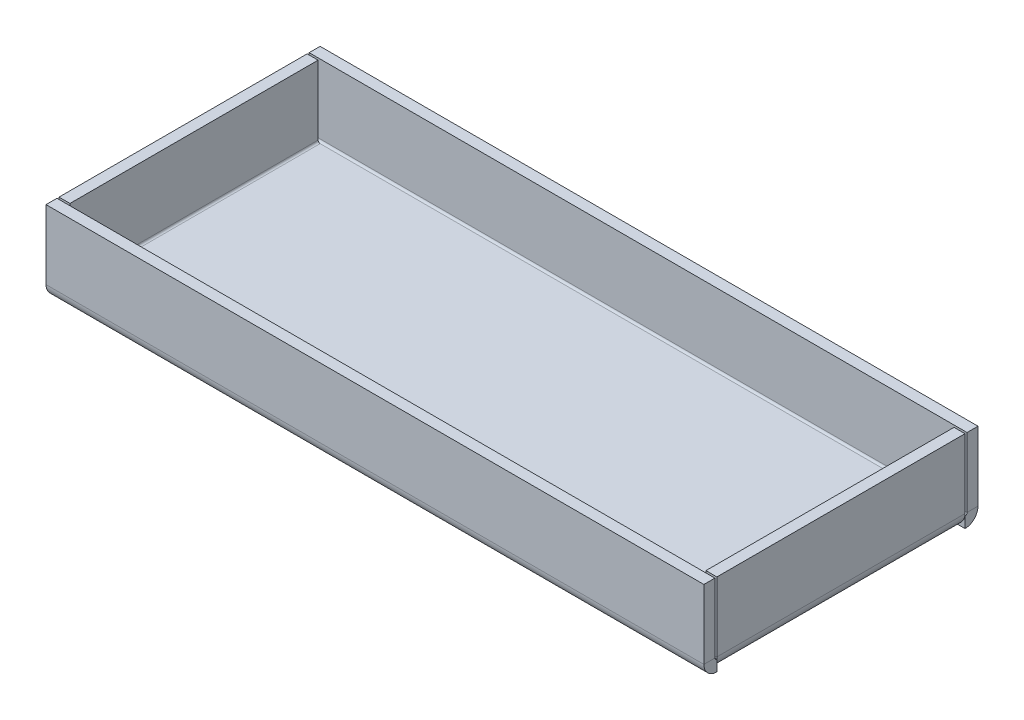
ISO-10303-21;
HEADER;
FILE_DESCRIPTION(('STEP AP214'),'2;1');
FILE_NAME('part.step','',(''),(''),'','','');
FILE_SCHEMA(('AUTOMOTIVE_DESIGN { 1 0 10303 214 1 1 1 1 }'));
ENDSEC;
DATA;
#1=APPLICATION_CONTEXT('core data for automotive mechanical design processes');
#2=APPLICATION_PROTOCOL_DEFINITION('international standard','automotive_design',2000,#1);
#3=PRODUCT_CONTEXT('',#1,'mechanical');
#4=PRODUCT('Part','Part','',(#3));
#5=PRODUCT_RELATED_PRODUCT_CATEGORY('part','',(#4));
#6=PRODUCT_DEFINITION_FORMATION('','',#4);
#7=PRODUCT_DEFINITION_CONTEXT('part definition',#1,'design');
#8=PRODUCT_DEFINITION('design','',#6,#7);
#9=PRODUCT_DEFINITION_SHAPE('','',#8);
#10=(LENGTH_UNIT() NAMED_UNIT(*) SI_UNIT(.MILLI.,.METRE.));
#11=(NAMED_UNIT(*) PLANE_ANGLE_UNIT() SI_UNIT($,.RADIAN.));
#12=(NAMED_UNIT(*) SI_UNIT($,.STERADIAN.) SOLID_ANGLE_UNIT());
#13=UNCERTAINTY_MEASURE_WITH_UNIT(LENGTH_MEASURE(1.E-05),#10,'distance_accuracy_value','');
#14=(GEOMETRIC_REPRESENTATION_CONTEXT(3) GLOBAL_UNCERTAINTY_ASSIGNED_CONTEXT((#13)) GLOBAL_UNIT_ASSIGNED_CONTEXT((#10,
#11,#12)) REPRESENTATION_CONTEXT('',''));
#15=CARTESIAN_POINT('',(0.,0.,0.));
#16=DIRECTION('',(0.,0.,1.));
#17=DIRECTION('',(1.,0.,0.));
#18=AXIS2_PLACEMENT_3D('',#15,#16,#17);
#19=CARTESIAN_POINT('',(0.,4.,-4.7366));
#20=DIRECTION('',(0.,0.,-1.));
#21=DIRECTION('',(-1.,0.,0.));
#22=AXIS2_PLACEMENT_3D('',#19,#20,#21);
#23=PLANE('',#22);
#24=DIRECTION('',(1.,0.,0.));
#25=VECTOR('',#24,1.);
#26=CARTESIAN_POINT('',(0.,4.,-4.7366));
#27=LINE('',#26,#25);
#28=CARTESIAN_POINT('',(0.,4.,-4.7366));
#29=VERTEX_POINT('',#28);
#30=CARTESIAN_POINT('',(0.0576257534369755,4.,-4.7366));
#31=VERTEX_POINT('',#30);
#32=EDGE_CURVE('E456',#29,#31,#27,.T.);
#33=ORIENTED_EDGE('',*,*,#32,.T.);
#34=CARTESIAN_POINT('',(4.7366,4.7366,-4.73659999999999));
#35=DIRECTION('',(0.,0.,1.));
#36=DIRECTION('',(1.,0.,0.));
#37=AXIS2_PLACEMENT_3D('',#34,#35,#36);
#38=CIRCLE('',#37,4.7366);
#39=CARTESIAN_POINT('',(4.7366,0.,-4.73659999999999));
#40=VERTEX_POINT('',#39);
#41=EDGE_CURVE('E13',#31,#40,#38,.T.);
#42=ORIENTED_EDGE('',*,*,#41,.T.);
#43=DIRECTION('',(1.,0.,0.));
#44=VECTOR('',#43,1.);
#45=CARTESIAN_POINT('',(240.,0.,-4.73659999999987));
#46=LINE('',#45,#44);
#47=CARTESIAN_POINT('',(0.,0.,-4.7366));
#48=VERTEX_POINT('',#47);
#49=EDGE_CURVE('E459',#48,#40,#46,.T.);
#50=ORIENTED_EDGE('',*,*,#49,.F.);
#51=DIRECTION('',(0.,-1.,0.));
#52=VECTOR('',#51,1.);
#53=CARTESIAN_POINT('',(0.,4.,-4.7366));
#54=LINE('',#53,#52);
#55=EDGE_CURVE('E548',#29,#48,#54,.T.);
#56=ORIENTED_EDGE('',*,*,#55,.F.);
#57=EDGE_LOOP('',(#33,#42,#50,#56));
#58=FACE_BOUND('',#57,.T.);
#59=ADVANCED_FACE('F116',(#58),#23,.T.);
#60=CARTESIAN_POINT('',(4.7366,4.,-95.2634));
#61=DIRECTION('',(0.,0.,1.));
#62=DIRECTION('',(0.,-1.,0.));
#63=AXIS2_PLACEMENT_3D('',#60,#61,#62);
#64=PLANE('',#63);
#65=DIRECTION('',(-1.,0.,0.));
#66=VECTOR('',#65,1.);
#67=CARTESIAN_POINT('',(0.,0.,-95.2634));
#68=LINE('',#67,#66);
#69=CARTESIAN_POINT('',(0.,0.,-95.2634));
#70=VERTEX_POINT('',#69);
#71=CARTESIAN_POINT('',(4.7366,0.,-95.2634));
#72=VERTEX_POINT('',#71);
#73=EDGE_CURVE('E490',#70,#72,#68,.F.);
#74=ORIENTED_EDGE('',*,*,#73,.T.);
#75=CARTESIAN_POINT('',(4.7366,4.7366,-95.2634));
#76=DIRECTION('',(0.,0.,1.));
#77=DIRECTION('',(1.,0.,0.));
#78=AXIS2_PLACEMENT_3D('',#75,#76,#77);
#79=CIRCLE('',#78,4.7366);
#80=CARTESIAN_POINT('',(0.0576257534369755,4.,-95.2634));
#81=VERTEX_POINT('',#80);
#82=EDGE_CURVE('E397',#72,#81,#79,.F.);
#83=ORIENTED_EDGE('',*,*,#82,.T.);
#84=DIRECTION('',(-1.,0.,0.));
#85=VECTOR('',#84,1.);
#86=CARTESIAN_POINT('',(0.,4.,-95.2634));
#87=LINE('',#86,#85);
#88=CARTESIAN_POINT('',(0.,4.,-95.2634));
#89=VERTEX_POINT('',#88);
#90=EDGE_CURVE('E500',#89,#81,#87,.F.);
#91=ORIENTED_EDGE('',*,*,#90,.F.);
#92=DIRECTION('',(0.,-1.,0.));
#93=VECTOR('',#92,1.);
#94=CARTESIAN_POINT('',(0.,4.,-95.2634));
#95=LINE('',#94,#93);
#96=EDGE_CURVE('E496',#89,#70,#95,.T.);
#97=ORIENTED_EDGE('',*,*,#96,.T.);
#98=EDGE_LOOP('',(#74,#83,#91,#97));
#99=FACE_BOUND('',#98,.T.);
#100=ADVANCED_FACE('F630',(#99),#64,.T.);
#101=CARTESIAN_POINT('',(240.,4.,-95.2634));
#102=DIRECTION('',(0.,0.,1.));
#103=DIRECTION('',(0.,-1.,0.));
#104=AXIS2_PLACEMENT_3D('',#101,#102,#103);
#105=PLANE('',#104);
#106=DIRECTION('',(-1.,0.,0.));
#107=VECTOR('',#106,1.);
#108=CARTESIAN_POINT('',(240.,4.,-95.2634));
#109=LINE('',#108,#107);
#110=CARTESIAN_POINT('',(240.,4.,-95.2634));
#111=VERTEX_POINT('',#110);
#112=CARTESIAN_POINT('',(239.942374246563,4.,-95.2634));
#113=VERTEX_POINT('',#112);
#114=EDGE_CURVE('E463',#111,#113,#109,.T.);
#115=ORIENTED_EDGE('',*,*,#114,.T.);
#116=CARTESIAN_POINT('',(235.2634,4.73660000000001,-95.2634));
#117=DIRECTION('',(0.,0.,-1.));
#118=DIRECTION('',(-1.,0.,0.));
#119=AXIS2_PLACEMENT_3D('',#116,#117,#118);
#120=CIRCLE('',#119,4.7366);
#121=CARTESIAN_POINT('',(235.2634,0.,-95.2634));
#122=VERTEX_POINT('',#121);
#123=EDGE_CURVE('E125',#113,#122,#120,.T.);
#124=ORIENTED_EDGE('',*,*,#123,.T.);
#125=DIRECTION('',(-1.,0.,0.));
#126=VECTOR('',#125,1.);
#127=CARTESIAN_POINT('',(0.,0.,-95.2634));
#128=LINE('',#127,#126);
#129=CARTESIAN_POINT('',(240.,0.,-95.2634));
#130=VERTEX_POINT('',#129);
#131=EDGE_CURVE('E247',#130,#122,#128,.T.);
#132=ORIENTED_EDGE('',*,*,#131,.F.);
#133=DIRECTION('',(0.,-1.,0.));
#134=VECTOR('',#133,1.);
#135=CARTESIAN_POINT('',(240.,4.,-95.2634));
#136=LINE('',#135,#134);
#137=EDGE_CURVE('E507',#111,#130,#136,.T.);
#138=ORIENTED_EDGE('',*,*,#137,.F.);
#139=EDGE_LOOP('',(#115,#124,#132,#138));
#140=FACE_BOUND('',#139,.T.);
#141=ADVANCED_FACE('F551',(#140),#105,.T.);
#142=CARTESIAN_POINT('',(235.2634,4.00000000000001,-4.73660000000001));
#143=DIRECTION('',(0.,0.,-1.));
#144=DIRECTION('',(-1.,0.,0.));
#145=AXIS2_PLACEMENT_3D('',#142,#143,#144);
#146=PLANE('',#145);
#147=DIRECTION('',(1.,0.,0.));
#148=VECTOR('',#147,1.);
#149=CARTESIAN_POINT('',(240.,0.,-4.7366));
#150=LINE('',#149,#148);
#151=CARTESIAN_POINT('',(240.,0.,-4.7366));
#152=VERTEX_POINT('',#151);
#153=CARTESIAN_POINT('',(235.2634,0.,-4.73660000000001));
#154=VERTEX_POINT('',#153);
#155=EDGE_CURVE('E534',#152,#154,#150,.F.);
#156=ORIENTED_EDGE('',*,*,#155,.T.);
#157=CARTESIAN_POINT('',(235.2634,4.73660000000001,-4.73660000000001));
#158=DIRECTION('',(0.,0.,-1.));
#159=DIRECTION('',(-1.,0.,0.));
#160=AXIS2_PLACEMENT_3D('',#157,#158,#159);
#161=CIRCLE('',#160,4.7366);
#162=CARTESIAN_POINT('',(239.942374246563,4.,-4.73660000000001));
#163=VERTEX_POINT('',#162);
#164=EDGE_CURVE('E442',#154,#163,#161,.F.);
#165=ORIENTED_EDGE('',*,*,#164,.T.);
#166=DIRECTION('',(1.,0.,0.));
#167=VECTOR('',#166,1.);
#168=CARTESIAN_POINT('',(240.,4.,-4.7366));
#169=LINE('',#168,#167);
#170=CARTESIAN_POINT('',(240.,4.,-4.7366));
#171=VERTEX_POINT('',#170);
#172=EDGE_CURVE('E542',#171,#163,#169,.F.);
#173=ORIENTED_EDGE('',*,*,#172,.F.);
#174=DIRECTION('',(0.,-1.,0.));
#175=VECTOR('',#174,1.);
#176=CARTESIAN_POINT('',(240.,4.,-4.7366));
#177=LINE('',#176,#175);
#178=EDGE_CURVE('E120',#171,#152,#177,.T.);
#179=ORIENTED_EDGE('',*,*,#178,.T.);
#180=EDGE_LOOP('',(#156,#165,#173,#179));
#181=FACE_BOUND('',#180,.T.);
#182=ADVANCED_FACE('F596',(#181),#146,.T.);
#183=CARTESIAN_POINT('',(0.,4.,0.));
#184=DIRECTION('',(0.,-1.,0.));
#185=DIRECTION('',(0.,0.,-1.));
#186=AXIS2_PLACEMENT_3D('',#183,#184,#185);
#187=PLANE('',#186);
#188=DIRECTION('',(0.,0.,1.));
#189=VECTOR('',#188,1.);
#190=CARTESIAN_POINT('',(4.7366,4.,-4.73659999999999));
#191=LINE('',#190,#189);
#192=CARTESIAN_POINT('',(4.7366,4.,-4.73659999999999));
#193=VERTEX_POINT('',#192);
#194=CARTESIAN_POINT('',(4.7366,4.,-95.2634));
#195=VERTEX_POINT('',#194);
#196=EDGE_CURVE('E402',#193,#195,#191,.F.);
#197=ORIENTED_EDGE('',*,*,#196,.F.);
#198=CARTESIAN_POINT('',(235.2634,4.00000000000001,-4.73660000000001));
#199=VERTEX_POINT('',#198);
#200=EDGE_CURVE('E546',#199,#193,#169,.F.);
#201=ORIENTED_EDGE('',*,*,#200,.F.);
#202=DIRECTION('',(0.,0.,-1.));
#203=VECTOR('',#202,1.);
#204=CARTESIAN_POINT('',(235.2634,4.00000000000001,-95.2634));
#205=LINE('',#204,#203);
#206=CARTESIAN_POINT('',(235.2634,4.00000000000001,-95.2634));
#207=VERTEX_POINT('',#206);
#208=EDGE_CURVE('E451',#207,#199,#205,.F.);
#209=ORIENTED_EDGE('',*,*,#208,.F.);
#210=EDGE_CURVE('E504',#195,#207,#87,.F.);
#211=ORIENTED_EDGE('',*,*,#210,.F.);
#212=EDGE_LOOP('',(#197,#201,#209,#211));
#213=FACE_BOUND('',#212,.T.);
#214=ADVANCED_FACE('F642',(#213),#187,.F.);
#215=CARTESIAN_POINT('',(0.,0.,0.));
#216=DIRECTION('',(0.,-1.,0.));
#217=DIRECTION('',(0.,0.,-1.));
#218=AXIS2_PLACEMENT_3D('',#215,#216,#217);
#219=PLANE('',#218);
#220=EDGE_CURVE('E537',#154,#40,#150,.F.);
#221=ORIENTED_EDGE('',*,*,#220,.T.);
#222=DIRECTION('',(0.,0.,1.));
#223=VECTOR('',#222,1.);
#224=CARTESIAN_POINT('',(4.7366,0.,-4.73659999999999));
#225=LINE('',#224,#223);
#226=EDGE_CURVE('E351',#40,#72,#225,.F.);
#227=ORIENTED_EDGE('',*,*,#226,.T.);
#228=EDGE_CURVE('E494',#72,#122,#68,.F.);
#229=ORIENTED_EDGE('',*,*,#228,.T.);
#230=DIRECTION('',(0.,0.,-1.));
#231=VECTOR('',#230,1.);
#232=CARTESIAN_POINT('',(235.2634,0.,-95.2634));
#233=LINE('',#232,#231);
#234=EDGE_CURVE('E437',#122,#154,#233,.F.);
#235=ORIENTED_EDGE('',*,*,#234,.T.);
#236=EDGE_LOOP('',(#221,#227,#229,#235));
#237=FACE_BOUND('',#236,.T.);
#238=ADVANCED_FACE('F118',(#237),#219,.T.);
#239=CARTESIAN_POINT('',(0.,4.7366,-4.7366));
#240=DIRECTION('',(-1.,0.,0.));
#241=DIRECTION('',(0.,0.,1.));
#242=AXIS2_PLACEMENT_3D('',#239,#240,#241);
#243=PLANE('',#242);
#244=DIRECTION('',(0.,0.,1.));
#245=VECTOR('',#244,1.);
#246=CARTESIAN_POINT('',(0.,4.7366,0.));
#247=LINE('',#246,#245);
#248=CARTESIAN_POINT('',(0.,4.73659999999999,-4.));
#249=VERTEX_POINT('',#248);
#250=CARTESIAN_POINT('',(0.,4.73659999999998,0.));
#251=VERTEX_POINT('',#250);
#252=EDGE_CURVE('E156',#249,#251,#247,.T.);
#253=ORIENTED_EDGE('',*,*,#252,.F.);
#254=CARTESIAN_POINT('',(0.,4.7366,-4.7366));
#255=DIRECTION('',(1.,0.,0.));
#256=DIRECTION('',(0.,0.,-1.));
#257=AXIS2_PLACEMENT_3D('',#254,#255,#256);
#258=CIRCLE('',#257,0.7366);
#259=EDGE_CURVE('E540',#29,#249,#258,.F.);
#260=ORIENTED_EDGE('',*,*,#259,.F.);
#261=ORIENTED_EDGE('',*,*,#55,.T.);
#262=CARTESIAN_POINT('',(0.,4.7366,-4.7366));
#263=DIRECTION('',(1.,0.,0.));
#264=DIRECTION('',(0.,0.,-1.));
#265=AXIS2_PLACEMENT_3D('',#262,#263,#264);
#266=CIRCLE('',#265,4.7366);
#267=EDGE_CURVE('E536',#48,#251,#266,.F.);
#268=ORIENTED_EDGE('',*,*,#267,.T.);
#269=EDGE_LOOP('',(#253,#260,#261,#268));
#270=FACE_BOUND('',#269,.T.);
#271=ADVANCED_FACE('F684',(#270),#243,.T.);
#272=CARTESIAN_POINT('',(240.,4.7366,-4.7366));
#273=DIRECTION('',(-1.,0.,0.));
#274=DIRECTION('',(0.,0.,1.));
#275=AXIS2_PLACEMENT_3D('',#272,#273,#274);
#276=PLANE('',#275);
#277=CARTESIAN_POINT('',(240.,4.7366,-4.7366));
#278=DIRECTION('',(1.,0.,0.));
#279=DIRECTION('',(0.,0.,-1.));
#280=AXIS2_PLACEMENT_3D('',#277,#278,#279);
#281=CIRCLE('',#280,0.7366);
#282=CARTESIAN_POINT('',(240.,4.73659999999999,-4.));
#283=VERTEX_POINT('',#282);
#284=EDGE_CURVE('E512',#283,#171,#281,.T.);
#285=ORIENTED_EDGE('',*,*,#284,.F.);
#286=DIRECTION('',(0.,0.,1.));
#287=VECTOR('',#286,1.);
#288=CARTESIAN_POINT('',(240.,4.7366,-4.));
#289=LINE('',#288,#287);
#290=CARTESIAN_POINT('',(240.,4.7366,0.));
#291=VERTEX_POINT('',#290);
#292=EDGE_CURVE('E529',#283,#291,#289,.T.);
#293=ORIENTED_EDGE('',*,*,#292,.T.);
#294=CARTESIAN_POINT('',(240.,4.7366,-4.7366));
#295=DIRECTION('',(1.,0.,0.));
#296=DIRECTION('',(0.,0.,-1.));
#297=AXIS2_PLACEMENT_3D('',#294,#295,#296);
#298=CIRCLE('',#297,4.7366);
#299=EDGE_CURVE('E162',#291,#152,#298,.T.);
#300=ORIENTED_EDGE('',*,*,#299,.T.);
#301=ORIENTED_EDGE('',*,*,#178,.F.);
#302=EDGE_LOOP('',(#285,#293,#300,#301));
#303=FACE_BOUND('',#302,.T.);
#304=ADVANCED_FACE('F603',(#303),#276,.F.);
#305=CARTESIAN_POINT('',(240.,4.7366,-4.7366));
#306=DIRECTION('',(1.,0.,0.));
#307=DIRECTION('',(0.,0.,1.));
#308=AXIS2_PLACEMENT_3D('',#305,#306,#307);
#309=CYLINDRICAL_SURFACE('',#308,4.7366);
#310=ORIENTED_EDGE('',*,*,#155,.F.);
#311=ORIENTED_EDGE('',*,*,#299,.F.);
#312=DIRECTION('',(1.,0.,0.));
#313=VECTOR('',#312,1.);
#314=CARTESIAN_POINT('',(0.,4.7366,0.));
#315=LINE('',#314,#313);
#316=EDGE_CURVE('E143',#251,#291,#315,.T.);
#317=ORIENTED_EDGE('',*,*,#316,.F.);
#318=ORIENTED_EDGE('',*,*,#267,.F.);
#319=ORIENTED_EDGE('',*,*,#49,.T.);
#320=ORIENTED_EDGE('',*,*,#220,.F.);
#321=EDGE_LOOP('',(#310,#311,#317,#318,#319,#320));
#322=FACE_BOUND('',#321,.T.);
#323=ADVANCED_FACE('F677',(#322),#309,.T.);
#324=CARTESIAN_POINT('',(240.,4.7366,-4.7366));
#325=DIRECTION('',(1.,0.,0.));
#326=DIRECTION('',(0.,0.,1.));
#327=AXIS2_PLACEMENT_3D('',#324,#325,#326);
#328=CYLINDRICAL_SURFACE('',#327,0.7366);
#329=ORIENTED_EDGE('',*,*,#172,.T.);
#330=EDGE_CURVE('E545',#163,#199,#169,.F.);
#331=ORIENTED_EDGE('',*,*,#330,.T.);
#332=ORIENTED_EDGE('',*,*,#200,.T.);
#333=EDGE_CURVE('E445',#31,#193,#27,.T.);
#334=ORIENTED_EDGE('',*,*,#333,.F.);
#335=ORIENTED_EDGE('',*,*,#32,.F.);
#336=ORIENTED_EDGE('',*,*,#259,.T.);
#337=DIRECTION('',(-1.,0.,0.));
#338=VECTOR('',#337,1.);
#339=CARTESIAN_POINT('',(0.,4.7366,-4.));
#340=LINE('',#339,#338);
#341=EDGE_CURVE('E531',#249,#283,#340,.F.);
#342=ORIENTED_EDGE('',*,*,#341,.T.);
#343=ORIENTED_EDGE('',*,*,#284,.T.);
#344=EDGE_LOOP('',(#329,#331,#332,#334,#335,#336,#342,#343));
#345=FACE_BOUND('',#344,.T.);
#346=ADVANCED_FACE('F598',(#345),#328,.F.);
#347=CARTESIAN_POINT('',(240.,3.99999999999999,0.));
#348=DIRECTION('',(1.,0.,0.));
#349=DIRECTION('',(0.,0.,-1.));
#350=AXIS2_PLACEMENT_3D('',#347,#348,#349);
#351=PLANE('',#350);
#352=DIRECTION('',(0.,-1.,0.));
#353=VECTOR('',#352,1.);
#354=CARTESIAN_POINT('',(240.,3.99999999999999,0.));
#355=LINE('',#354,#353);
#356=CARTESIAN_POINT('',(240.,30.,0.));
#357=VERTEX_POINT('',#356);
#358=EDGE_CURVE('E515',#357,#291,#355,.T.);
#359=ORIENTED_EDGE('',*,*,#358,.T.);
#360=ORIENTED_EDGE('',*,*,#292,.F.);
#361=DIRECTION('',(0.,1.,0.));
#362=VECTOR('',#361,1.);
#363=CARTESIAN_POINT('',(240.,0.,-4.00000000000001));
#364=LINE('',#363,#362);
#365=CARTESIAN_POINT('',(240.,30.,-3.99999999999991));
#366=VERTEX_POINT('',#365);
#367=EDGE_CURVE('E522',#366,#283,#364,.F.);
#368=ORIENTED_EDGE('',*,*,#367,.F.);
#369=DIRECTION('',(0.,0.,-1.));
#370=VECTOR('',#369,1.);
#371=CARTESIAN_POINT('',(240.,30.,0.));
#372=LINE('',#371,#370);
#373=EDGE_CURVE('E177',#357,#366,#372,.T.);
#374=ORIENTED_EDGE('',*,*,#373,.F.);
#375=EDGE_LOOP('',(#359,#360,#368,#374));
#376=FACE_BOUND('',#375,.T.);
#377=ADVANCED_FACE('F608',(#376),#351,.T.);
#378=CARTESIAN_POINT('',(0.,30.,0.));
#379=DIRECTION('',(-1.,0.,0.));
#380=DIRECTION('',(0.,0.,1.));
#381=AXIS2_PLACEMENT_3D('',#378,#379,#380);
#382=PLANE('',#381);
#383=DIRECTION('',(0.,-1.,0.));
#384=VECTOR('',#383,1.);
#385=CARTESIAN_POINT('',(0.,0.,-4.00000000000001));
#386=LINE('',#385,#384);
#387=CARTESIAN_POINT('',(0.,30.,-3.99999999999991));
#388=VERTEX_POINT('',#387);
#389=EDGE_CURVE('E184',#249,#388,#386,.F.);
#390=ORIENTED_EDGE('',*,*,#389,.F.);
#391=ORIENTED_EDGE('',*,*,#252,.T.);
#392=DIRECTION('',(0.,1.,0.));
#393=VECTOR('',#392,1.);
#394=CARTESIAN_POINT('',(0.,30.,0.));
#395=LINE('',#394,#393);
#396=CARTESIAN_POINT('',(0.,30.,0.));
#397=VERTEX_POINT('',#396);
#398=EDGE_CURVE('E520',#251,#397,#395,.T.);
#399=ORIENTED_EDGE('',*,*,#398,.T.);
#400=DIRECTION('',(0.,0.,-1.));
#401=VECTOR('',#400,1.);
#402=CARTESIAN_POINT('',(0.,30.,0.));
#403=LINE('',#402,#401);
#404=EDGE_CURVE('E513',#397,#388,#403,.T.);
#405=ORIENTED_EDGE('',*,*,#404,.T.);
#406=EDGE_LOOP('',(#390,#391,#399,#405));
#407=FACE_BOUND('',#406,.T.);
#408=ADVANCED_FACE('F616',(#407),#382,.T.);
#409=CARTESIAN_POINT('',(0.,0.,0.));
#410=DIRECTION('',(0.,0.,1.));
#411=DIRECTION('',(0.,-1.,0.));
#412=AXIS2_PLACEMENT_3D('',#409,#410,#411);
#413=PLANE('',#412);
#414=ORIENTED_EDGE('',*,*,#398,.F.);
#415=ORIENTED_EDGE('',*,*,#316,.T.);
#416=ORIENTED_EDGE('',*,*,#358,.F.);
#417=DIRECTION('',(1.,0.,0.));
#418=VECTOR('',#417,1.);
#419=CARTESIAN_POINT('',(240.,30.,0.));
#420=LINE('',#419,#418);
#421=EDGE_CURVE('E518',#397,#357,#420,.T.);
#422=ORIENTED_EDGE('',*,*,#421,.F.);
#423=EDGE_LOOP('',(#414,#415,#416,#422));
#424=FACE_BOUND('',#423,.T.);
#425=ADVANCED_FACE('F613',(#424),#413,.T.);
#426=CARTESIAN_POINT('',(0.,0.,-4.00000000000001));
#427=DIRECTION('',(0.,0.,1.));
#428=DIRECTION('',(0.,-1.,0.));
#429=AXIS2_PLACEMENT_3D('',#426,#427,#428);
#430=PLANE('',#429);
#431=ORIENTED_EDGE('',*,*,#341,.F.);
#432=ORIENTED_EDGE('',*,*,#389,.T.);
#433=DIRECTION('',(-1.,0.,0.));
#434=VECTOR('',#433,1.);
#435=CARTESIAN_POINT('',(0.,30.,-3.99999999999991));
#436=LINE('',#435,#434);
#437=EDGE_CURVE('E525',#388,#366,#436,.F.);
#438=ORIENTED_EDGE('',*,*,#437,.T.);
#439=ORIENTED_EDGE('',*,*,#367,.T.);
#440=EDGE_LOOP('',(#431,#432,#438,#439));
#441=FACE_BOUND('',#440,.T.);
#442=ADVANCED_FACE('F606',(#441),#430,.F.);
#443=CARTESIAN_POINT('',(240.,30.,0.));
#444=DIRECTION('',(0.,1.,0.));
#445=DIRECTION('',(0.,0.,1.));
#446=AXIS2_PLACEMENT_3D('',#443,#444,#445);
#447=PLANE('',#446);
#448=ORIENTED_EDGE('',*,*,#437,.F.);
#449=ORIENTED_EDGE('',*,*,#404,.F.);
#450=ORIENTED_EDGE('',*,*,#421,.T.);
#451=ORIENTED_EDGE('',*,*,#373,.T.);
#452=EDGE_LOOP('',(#448,#449,#450,#451));
#453=FACE_BOUND('',#452,.T.);
#454=ADVANCED_FACE('F617',(#453),#447,.T.);
#455=CARTESIAN_POINT('',(240.,4.7366,-95.2634));
#456=DIRECTION('',(1.,0.,0.));
#457=DIRECTION('',(0.,0.,-1.));
#458=AXIS2_PLACEMENT_3D('',#455,#456,#457);
#459=PLANE('',#458);
#460=DIRECTION('',(0.,0.,-1.));
#461=VECTOR('',#460,1.);
#462=CARTESIAN_POINT('',(240.,4.73660000000003,-100.));
#463=LINE('',#462,#461);
#464=CARTESIAN_POINT('',(240.,4.7366,-96.));
#465=VERTEX_POINT('',#464);
#466=CARTESIAN_POINT('',(240.,4.7366,-100.));
#467=VERTEX_POINT('',#466);
#468=EDGE_CURVE('E206',#465,#467,#463,.T.);
#469=ORIENTED_EDGE('',*,*,#468,.F.);
#470=CARTESIAN_POINT('',(240.,4.7366,-95.2634));
#471=DIRECTION('',(-1.,0.,0.));
#472=DIRECTION('',(0.,0.,1.));
#473=AXIS2_PLACEMENT_3D('',#470,#471,#472);
#474=CIRCLE('',#473,0.736600000000004);
#475=EDGE_CURVE('E498',#111,#465,#474,.F.);
#476=ORIENTED_EDGE('',*,*,#475,.F.);
#477=ORIENTED_EDGE('',*,*,#137,.T.);
#478=CARTESIAN_POINT('',(240.,4.7366,-95.2634));
#479=DIRECTION('',(-1.,0.,0.));
#480=DIRECTION('',(0.,0.,1.));
#481=AXIS2_PLACEMENT_3D('',#478,#479,#480);
#482=CIRCLE('',#481,4.7366);
#483=EDGE_CURVE('E493',#130,#467,#482,.F.);
#484=ORIENTED_EDGE('',*,*,#483,.T.);
#485=EDGE_LOOP('',(#469,#476,#477,#484));
#486=FACE_BOUND('',#485,.T.);
#487=ADVANCED_FACE('F559',(#486),#459,.T.);
#488=CARTESIAN_POINT('',(0.,4.7366,-95.2634));
#489=DIRECTION('',(1.,0.,0.));
#490=DIRECTION('',(0.,0.,-1.));
#491=AXIS2_PLACEMENT_3D('',#488,#489,#490);
#492=PLANE('',#491);
#493=CARTESIAN_POINT('',(0.,4.7366,-95.2634));
#494=DIRECTION('',(-1.,0.,0.));
#495=DIRECTION('',(0.,0.,1.));
#496=AXIS2_PLACEMENT_3D('',#493,#494,#495);
#497=CIRCLE('',#496,0.736600000000004);
#498=CARTESIAN_POINT('',(0.,4.7366,-96.));
#499=VERTEX_POINT('',#498);
#500=EDGE_CURVE('E468',#499,#89,#497,.T.);
#501=ORIENTED_EDGE('',*,*,#500,.F.);
#502=DIRECTION('',(0.,0.,-1.));
#503=VECTOR('',#502,1.);
#504=CARTESIAN_POINT('',(0.,4.73660000000001,-96.));
#505=LINE('',#504,#503);
#506=CARTESIAN_POINT('',(0.,4.73660000000003,-100.));
#507=VERTEX_POINT('',#506);
#508=EDGE_CURVE('E485',#499,#507,#505,.T.);
#509=ORIENTED_EDGE('',*,*,#508,.T.);
#510=CARTESIAN_POINT('',(0.,4.7366,-95.2634));
#511=DIRECTION('',(-1.,0.,0.));
#512=DIRECTION('',(0.,0.,1.));
#513=AXIS2_PLACEMENT_3D('',#510,#511,#512);
#514=CIRCLE('',#513,4.7366);
#515=EDGE_CURVE('E213',#507,#70,#514,.T.);
#516=ORIENTED_EDGE('',*,*,#515,.T.);
#517=ORIENTED_EDGE('',*,*,#96,.F.);
#518=EDGE_LOOP('',(#501,#509,#516,#517));
#519=FACE_BOUND('',#518,.T.);
#520=ADVANCED_FACE('F624',(#519),#492,.F.);
#521=CARTESIAN_POINT('',(0.,4.7366,-95.2634));
#522=DIRECTION('',(-1.,0.,0.));
#523=DIRECTION('',(0.,0.,-1.));
#524=AXIS2_PLACEMENT_3D('',#521,#522,#523);
#525=CYLINDRICAL_SURFACE('',#524,4.7366);
#526=ORIENTED_EDGE('',*,*,#73,.F.);
#527=ORIENTED_EDGE('',*,*,#515,.F.);
#528=DIRECTION('',(-1.,0.,0.));
#529=VECTOR('',#528,1.);
#530=CARTESIAN_POINT('',(0.,4.73660000000003,-100.));
#531=LINE('',#530,#529);
#532=EDGE_CURVE('E193',#467,#507,#531,.T.);
#533=ORIENTED_EDGE('',*,*,#532,.F.);
#534=ORIENTED_EDGE('',*,*,#483,.F.);
#535=ORIENTED_EDGE('',*,*,#131,.T.);
#536=ORIENTED_EDGE('',*,*,#228,.F.);
#537=EDGE_LOOP('',(#526,#527,#533,#534,#535,#536));
#538=FACE_BOUND('',#537,.T.);
#539=ADVANCED_FACE('F558',(#538),#525,.T.);
#540=CARTESIAN_POINT('',(0.,4.7366,-95.2634));
#541=DIRECTION('',(-1.,0.,0.));
#542=DIRECTION('',(0.,0.,-1.));
#543=AXIS2_PLACEMENT_3D('',#540,#541,#542);
#544=CYLINDRICAL_SURFACE('',#543,0.736600000000004);
#545=ORIENTED_EDGE('',*,*,#90,.T.);
#546=EDGE_CURVE('E503',#81,#195,#87,.F.);
#547=ORIENTED_EDGE('',*,*,#546,.T.);
#548=ORIENTED_EDGE('',*,*,#210,.T.);
#549=EDGE_CURVE('E462',#113,#207,#109,.T.);
#550=ORIENTED_EDGE('',*,*,#549,.F.);
#551=ORIENTED_EDGE('',*,*,#114,.F.);
#552=ORIENTED_EDGE('',*,*,#475,.T.);
#553=DIRECTION('',(1.,0.,0.));
#554=VECTOR('',#553,1.);
#555=CARTESIAN_POINT('',(240.,4.73660000000001,-96.));
#556=LINE('',#555,#554);
#557=EDGE_CURVE('E487',#465,#499,#556,.F.);
#558=ORIENTED_EDGE('',*,*,#557,.T.);
#559=ORIENTED_EDGE('',*,*,#500,.T.);
#560=EDGE_LOOP('',(#545,#547,#548,#550,#551,#552,#558,#559));
#561=FACE_BOUND('',#560,.T.);
#562=ADVANCED_FACE('F562',(#561),#544,.F.);
#563=CARTESIAN_POINT('',(0.,4.,-100.));
#564=DIRECTION('',(-1.,0.,0.));
#565=DIRECTION('',(0.,0.,1.));
#566=AXIS2_PLACEMENT_3D('',#563,#564,#565);
#567=PLANE('',#566);
#568=DIRECTION('',(0.,-1.,0.));
#569=VECTOR('',#568,1.);
#570=CARTESIAN_POINT('',(0.,4.,-100.));
#571=LINE('',#570,#569);
#572=CARTESIAN_POINT('',(0.,30.,-100.));
#573=VERTEX_POINT('',#572);
#574=EDGE_CURVE('E471',#573,#507,#571,.T.);
#575=ORIENTED_EDGE('',*,*,#574,.T.);
#576=ORIENTED_EDGE('',*,*,#508,.F.);
#577=DIRECTION('',(0.,1.,0.));
#578=VECTOR('',#577,1.);
#579=CARTESIAN_POINT('',(0.,0.,-96.));
#580=LINE('',#579,#578);
#581=CARTESIAN_POINT('',(0.,30.,-96.));
#582=VERTEX_POINT('',#581);
#583=EDGE_CURVE('E478',#582,#499,#580,.F.);
#584=ORIENTED_EDGE('',*,*,#583,.F.);
#585=DIRECTION('',(0.,0.,1.));
#586=VECTOR('',#585,1.);
#587=CARTESIAN_POINT('',(0.,30.,-100.));
#588=LINE('',#587,#586);
#589=EDGE_CURVE('E228',#573,#582,#588,.T.);
#590=ORIENTED_EDGE('',*,*,#589,.F.);
#591=EDGE_LOOP('',(#575,#576,#584,#590));
#592=FACE_BOUND('',#591,.T.);
#593=ADVANCED_FACE('F654',(#592),#567,.T.);
#594=CARTESIAN_POINT('',(240.,30.,-100.));
#595=DIRECTION('',(1.,0.,0.));
#596=DIRECTION('',(0.,0.,-1.));
#597=AXIS2_PLACEMENT_3D('',#594,#595,#596);
#598=PLANE('',#597);
#599=DIRECTION('',(0.,-1.,0.));
#600=VECTOR('',#599,1.);
#601=CARTESIAN_POINT('',(240.,0.,-96.));
#602=LINE('',#601,#600);
#603=CARTESIAN_POINT('',(240.,30.,-96.));
#604=VERTEX_POINT('',#603);
#605=EDGE_CURVE('E234',#465,#604,#602,.F.);
#606=ORIENTED_EDGE('',*,*,#605,.F.);
#607=ORIENTED_EDGE('',*,*,#468,.T.);
#608=DIRECTION('',(0.,1.,0.));
#609=VECTOR('',#608,1.);
#610=CARTESIAN_POINT('',(240.,30.,-100.));
#611=LINE('',#610,#609);
#612=CARTESIAN_POINT('',(240.,30.,-100.));
#613=VERTEX_POINT('',#612);
#614=EDGE_CURVE('E476',#467,#613,#611,.T.);
#615=ORIENTED_EDGE('',*,*,#614,.T.);
#616=DIRECTION('',(0.,0.,1.));
#617=VECTOR('',#616,1.);
#618=CARTESIAN_POINT('',(240.,30.,-100.));
#619=LINE('',#618,#617);
#620=EDGE_CURVE('E469',#613,#604,#619,.T.);
#621=ORIENTED_EDGE('',*,*,#620,.T.);
#622=EDGE_LOOP('',(#606,#607,#615,#621));
#623=FACE_BOUND('',#622,.T.);
#624=ADVANCED_FACE('F649',(#623),#598,.T.);
#625=CARTESIAN_POINT('',(0.,0.,-100.));
#626=DIRECTION('',(0.,0.,-1.));
#627=DIRECTION('',(-1.,0.,0.));
#628=AXIS2_PLACEMENT_3D('',#625,#626,#627);
#629=PLANE('',#628);
#630=ORIENTED_EDGE('',*,*,#614,.F.);
#631=ORIENTED_EDGE('',*,*,#532,.T.);
#632=ORIENTED_EDGE('',*,*,#574,.F.);
#633=DIRECTION('',(-1.,0.,0.));
#634=VECTOR('',#633,1.);
#635=CARTESIAN_POINT('',(0.,30.,-100.));
#636=LINE('',#635,#634);
#637=EDGE_CURVE('E474',#613,#573,#636,.T.);
#638=ORIENTED_EDGE('',*,*,#637,.F.);
#639=EDGE_LOOP('',(#630,#631,#632,#638));
#640=FACE_BOUND('',#639,.T.);
#641=ADVANCED_FACE('F645',(#640),#629,.T.);
#642=CARTESIAN_POINT('',(0.,0.,-96.));
#643=DIRECTION('',(0.,0.,-1.));
#644=DIRECTION('',(-1.,0.,0.));
#645=AXIS2_PLACEMENT_3D('',#642,#643,#644);
#646=PLANE('',#645);
#647=ORIENTED_EDGE('',*,*,#557,.F.);
#648=ORIENTED_EDGE('',*,*,#605,.T.);
#649=DIRECTION('',(1.,0.,0.));
#650=VECTOR('',#649,1.);
#651=CARTESIAN_POINT('',(0.,30.,-96.));
#652=LINE('',#651,#650);
#653=EDGE_CURVE('E481',#604,#582,#652,.F.);
#654=ORIENTED_EDGE('',*,*,#653,.T.);
#655=ORIENTED_EDGE('',*,*,#583,.T.);
#656=EDGE_LOOP('',(#647,#648,#654,#655));
#657=FACE_BOUND('',#656,.T.);
#658=ADVANCED_FACE('F648',(#657),#646,.F.);
#659=CARTESIAN_POINT('',(0.,30.,-100.));
#660=DIRECTION('',(0.,1.,0.));
#661=DIRECTION('',(0.,0.,1.));
#662=AXIS2_PLACEMENT_3D('',#659,#660,#661);
#663=PLANE('',#662);
#664=ORIENTED_EDGE('',*,*,#653,.F.);
#665=ORIENTED_EDGE('',*,*,#620,.F.);
#666=ORIENTED_EDGE('',*,*,#637,.T.);
#667=ORIENTED_EDGE('',*,*,#589,.T.);
#668=EDGE_LOOP('',(#664,#665,#666,#667));
#669=FACE_BOUND('',#668,.T.);
#670=ADVANCED_FACE('F653',(#669),#663,.T.);
#671=CARTESIAN_POINT('',(235.2634,4.73660000000001,-4.73660000000001));
#672=DIRECTION('',(0.,0.,1.));
#673=DIRECTION('',(1.,0.,0.));
#674=AXIS2_PLACEMENT_3D('',#671,#672,#673);
#675=PLANE('',#674);
#676=ORIENTED_EDGE('',*,*,#330,.F.);
#677=CARTESIAN_POINT('',(240.,4.73659999999999,-4.73660000000001));
#678=VERTEX_POINT('',#677);
#679=EDGE_CURVE('E440',#163,#678,#161,.F.);
#680=ORIENTED_EDGE('',*,*,#679,.T.);
#681=DIRECTION('',(1.,0.,0.));
#682=VECTOR('',#681,1.);
#683=CARTESIAN_POINT('',(240.,4.73659999999999,-4.7366));
#684=LINE('',#683,#682);
#685=CARTESIAN_POINT('',(236.,4.73660000000001,-4.73660000000001));
#686=VERTEX_POINT('',#685);
#687=EDGE_CURVE('E399',#686,#678,#684,.T.);
#688=ORIENTED_EDGE('',*,*,#687,.F.);
#689=CARTESIAN_POINT('',(235.2634,4.73660000000001,-4.73660000000001));
#690=DIRECTION('',(0.,0.,-1.));
#691=DIRECTION('',(-1.,0.,0.));
#692=AXIS2_PLACEMENT_3D('',#689,#690,#691);
#693=CIRCLE('',#692,0.736600000000004);
#694=EDGE_CURVE('E448',#199,#686,#693,.F.);
#695=ORIENTED_EDGE('',*,*,#694,.F.);
#696=EDGE_LOOP('',(#676,#680,#688,#695));
#697=FACE_BOUND('',#696,.T.);
#698=ADVANCED_FACE('F660',(#697),#675,.T.);
#699=CARTESIAN_POINT('',(235.2634,4.73660000000001,-95.2634));
#700=DIRECTION('',(0.,0.,1.));
#701=DIRECTION('',(1.,0.,0.));
#702=AXIS2_PLACEMENT_3D('',#699,#700,#701);
#703=PLANE('',#702);
#704=CARTESIAN_POINT('',(240.,4.73659999999999,-95.2634));
#705=VERTEX_POINT('',#704);
#706=EDGE_CURVE('E441',#705,#113,#120,.T.);
#707=ORIENTED_EDGE('',*,*,#706,.T.);
#708=ORIENTED_EDGE('',*,*,#549,.T.);
#709=CARTESIAN_POINT('',(235.2634,4.73660000000001,-95.2634));
#710=DIRECTION('',(0.,0.,-1.));
#711=DIRECTION('',(-1.,0.,0.));
#712=AXIS2_PLACEMENT_3D('',#709,#710,#711);
#713=CIRCLE('',#712,0.736600000000004);
#714=CARTESIAN_POINT('',(236.,4.73660000000001,-95.2634));
#715=VERTEX_POINT('',#714);
#716=EDGE_CURVE('E407',#715,#207,#713,.T.);
#717=ORIENTED_EDGE('',*,*,#716,.F.);
#718=DIRECTION('',(1.,0.,0.));
#719=VECTOR('',#718,1.);
#720=CARTESIAN_POINT('',(236.,4.73660000000001,-95.2634));
#721=LINE('',#720,#719);
#722=EDGE_CURVE('E430',#715,#705,#721,.T.);
#723=ORIENTED_EDGE('',*,*,#722,.T.);
#724=EDGE_LOOP('',(#707,#708,#717,#723));
#725=FACE_BOUND('',#724,.T.);
#726=ADVANCED_FACE('F569',(#725),#703,.F.);
#727=CARTESIAN_POINT('',(235.2634,4.73660000000001,-95.2634));
#728=DIRECTION('',(0.,0.,-1.));
#729=DIRECTION('',(1.,0.,0.));
#730=AXIS2_PLACEMENT_3D('',#727,#728,#729);
#731=CYLINDRICAL_SURFACE('',#730,4.7366);
#732=ORIENTED_EDGE('',*,*,#234,.F.);
#733=ORIENTED_EDGE('',*,*,#123,.F.);
#734=ORIENTED_EDGE('',*,*,#706,.F.);
#735=DIRECTION('',(0.,0.,-1.));
#736=VECTOR('',#735,1.);
#737=CARTESIAN_POINT('',(240.,4.73659999999999,0.));
#738=LINE('',#737,#736);
#739=EDGE_CURVE('E427',#678,#705,#738,.T.);
#740=ORIENTED_EDGE('',*,*,#739,.F.);
#741=ORIENTED_EDGE('',*,*,#679,.F.);
#742=ORIENTED_EDGE('',*,*,#164,.F.);
#743=EDGE_LOOP('',(#732,#733,#734,#740,#741,#742));
#744=FACE_BOUND('',#743,.T.);
#745=ADVANCED_FACE('F594',(#744),#731,.T.);
#746=CARTESIAN_POINT('',(235.2634,4.73660000000001,-95.2634));
#747=DIRECTION('',(0.,0.,-1.));
#748=DIRECTION('',(1.,0.,0.));
#749=AXIS2_PLACEMENT_3D('',#746,#747,#748);
#750=CYLINDRICAL_SURFACE('',#749,0.736600000000004);
#751=ORIENTED_EDGE('',*,*,#208,.T.);
#752=ORIENTED_EDGE('',*,*,#694,.T.);
#753=DIRECTION('',(0.,0.,1.));
#754=VECTOR('',#753,1.);
#755=CARTESIAN_POINT('',(236.,4.73660000000001,-4.7366));
#756=LINE('',#755,#754);
#757=EDGE_CURVE('E433',#686,#715,#756,.F.);
#758=ORIENTED_EDGE('',*,*,#757,.T.);
#759=ORIENTED_EDGE('',*,*,#716,.T.);
#760=EDGE_LOOP('',(#751,#752,#758,#759));
#761=FACE_BOUND('',#760,.T.);
#762=ADVANCED_FACE('F571',(#761),#750,.F.);
#763=CARTESIAN_POINT('',(240.,3.99999999999998,-95.2634));
#764=DIRECTION('',(0.,0.,-1.));
#765=DIRECTION('',(0.,1.,0.));
#766=AXIS2_PLACEMENT_3D('',#763,#764,#765);
#767=PLANE('',#766);
#768=DIRECTION('',(0.,-1.,0.));
#769=VECTOR('',#768,1.);
#770=CARTESIAN_POINT('',(240.,3.99999999999998,-95.2634));
#771=LINE('',#770,#769);
#772=CARTESIAN_POINT('',(240.,30.,-95.2634));
#773=VERTEX_POINT('',#772);
#774=EDGE_CURVE('E411',#773,#705,#771,.T.);
#775=ORIENTED_EDGE('',*,*,#774,.T.);
#776=ORIENTED_EDGE('',*,*,#722,.F.);
#777=DIRECTION('',(0.,1.,0.));
#778=VECTOR('',#777,1.);
#779=CARTESIAN_POINT('',(236.,-8.19463834396299E-13,-95.2634));
#780=LINE('',#779,#778);
#781=CARTESIAN_POINT('',(236.,30.,-95.2634));
#782=VERTEX_POINT('',#781);
#783=EDGE_CURVE('E419',#782,#715,#780,.F.);
#784=ORIENTED_EDGE('',*,*,#783,.F.);
#785=DIRECTION('',(-1.,0.,0.));
#786=VECTOR('',#785,1.);
#787=CARTESIAN_POINT('',(240.,30.,-95.2634));
#788=LINE('',#787,#786);
#789=EDGE_CURVE('E405',#773,#782,#788,.T.);
#790=ORIENTED_EDGE('',*,*,#789,.F.);
#791=EDGE_LOOP('',(#775,#776,#784,#790));
#792=FACE_BOUND('',#791,.T.);
#793=ADVANCED_FACE('F588',(#792),#767,.T.);
#794=CARTESIAN_POINT('',(240.,30.,-4.7366));
#795=DIRECTION('',(0.,0.,1.));
#796=DIRECTION('',(0.,-1.,0.));
#797=AXIS2_PLACEMENT_3D('',#794,#795,#796);
#798=PLANE('',#797);
#799=DIRECTION('',(0.,-1.,0.));
#800=VECTOR('',#799,1.);
#801=CARTESIAN_POINT('',(236.,-7.70038059758701E-13,-4.7366));
#802=LINE('',#801,#800);
#803=CARTESIAN_POINT('',(236.,30.,-4.7366));
#804=VERTEX_POINT('',#803);
#805=EDGE_CURVE('E425',#686,#804,#802,.F.);
#806=ORIENTED_EDGE('',*,*,#805,.F.);
#807=ORIENTED_EDGE('',*,*,#687,.T.);
#808=DIRECTION('',(0.,1.,0.));
#809=VECTOR('',#808,1.);
#810=CARTESIAN_POINT('',(240.,30.,-4.7366));
#811=LINE('',#810,#809);
#812=CARTESIAN_POINT('',(240.,30.,-4.73660000000001));
#813=VERTEX_POINT('',#812);
#814=EDGE_CURVE('E417',#678,#813,#811,.T.);
#815=ORIENTED_EDGE('',*,*,#814,.T.);
#816=DIRECTION('',(-1.,0.,0.));
#817=VECTOR('',#816,1.);
#818=CARTESIAN_POINT('',(240.,30.,-4.7366));
#819=LINE('',#818,#817);
#820=EDGE_CURVE('E408',#813,#804,#819,.T.);
#821=ORIENTED_EDGE('',*,*,#820,.T.);
#822=EDGE_LOOP('',(#806,#807,#815,#821));
#823=FACE_BOUND('',#822,.T.);
#824=ADVANCED_FACE('F580',(#823),#798,.T.);
#825=CARTESIAN_POINT('',(240.,-7.82581865480481E-13,0.));
#826=DIRECTION('',(1.,0.,0.));
#827=DIRECTION('',(0.,1.,0.));
#828=AXIS2_PLACEMENT_3D('',#825,#826,#827);
#829=PLANE('',#828);
#830=ORIENTED_EDGE('',*,*,#814,.F.);
#831=ORIENTED_EDGE('',*,*,#739,.T.);
#832=ORIENTED_EDGE('',*,*,#774,.F.);
#833=DIRECTION('',(0.,0.,-1.));
#834=VECTOR('',#833,1.);
#835=CARTESIAN_POINT('',(240.,30.,-95.2634));
#836=LINE('',#835,#834);
#837=EDGE_CURVE('E414',#813,#773,#836,.T.);
#838=ORIENTED_EDGE('',*,*,#837,.F.);
#839=EDGE_LOOP('',(#830,#831,#832,#838));
#840=FACE_BOUND('',#839,.T.);
#841=ADVANCED_FACE('F592',(#840),#829,.T.);
#842=CARTESIAN_POINT('',(236.,-7.68615940125108E-13,0.));
#843=DIRECTION('',(1.,0.,0.));
#844=DIRECTION('',(0.,1.,0.));
#845=AXIS2_PLACEMENT_3D('',#842,#843,#844);
#846=PLANE('',#845);
#847=ORIENTED_EDGE('',*,*,#757,.F.);
#848=ORIENTED_EDGE('',*,*,#805,.T.);
#849=DIRECTION('',(0.,0.,1.));
#850=VECTOR('',#849,1.);
#851=CARTESIAN_POINT('',(236.,30.,0.));
#852=LINE('',#851,#850);
#853=EDGE_CURVE('E422',#804,#782,#852,.F.);
#854=ORIENTED_EDGE('',*,*,#853,.T.);
#855=ORIENTED_EDGE('',*,*,#783,.T.);
#856=EDGE_LOOP('',(#847,#848,#854,#855));
#857=FACE_BOUND('',#856,.T.);
#858=ADVANCED_FACE('F576',(#857),#846,.F.);
#859=CARTESIAN_POINT('',(240.,30.,-95.2634));
#860=DIRECTION('',(0.,1.,0.));
#861=DIRECTION('',(-1.,0.,0.));
#862=AXIS2_PLACEMENT_3D('',#859,#860,#861);
#863=PLANE('',#862);
#864=ORIENTED_EDGE('',*,*,#853,.F.);
#865=ORIENTED_EDGE('',*,*,#820,.F.);
#866=ORIENTED_EDGE('',*,*,#837,.T.);
#867=ORIENTED_EDGE('',*,*,#789,.T.);
#868=EDGE_LOOP('',(#864,#865,#866,#867));
#869=FACE_BOUND('',#868,.T.);
#870=ADVANCED_FACE('F586',(#869),#863,.T.);
#871=CARTESIAN_POINT('',(4.7366,4.7366,-95.2634));
#872=DIRECTION('',(0.,0.,-1.));
#873=DIRECTION('',(-1.,0.,0.));
#874=AXIS2_PLACEMENT_3D('',#871,#872,#873);
#875=PLANE('',#874);
#876=ORIENTED_EDGE('',*,*,#546,.F.);
#877=CARTESIAN_POINT('',(0.,4.73659999999998,-95.2634));
#878=VERTEX_POINT('',#877);
#879=EDGE_CURVE('E396',#81,#878,#79,.F.);
#880=ORIENTED_EDGE('',*,*,#879,.T.);
#881=DIRECTION('',(-1.,0.,0.));
#882=VECTOR('',#881,1.);
#883=CARTESIAN_POINT('',(0.,4.73659999999998,-95.2634));
#884=LINE('',#883,#882);
#885=CARTESIAN_POINT('',(4.,4.7366,-95.2634));
#886=VERTEX_POINT('',#885);
#887=EDGE_CURVE('E392',#886,#878,#884,.T.);
#888=ORIENTED_EDGE('',*,*,#887,.F.);
#889=CARTESIAN_POINT('',(4.7366,4.7366,-95.2634));
#890=DIRECTION('',(0.,0.,1.));
#891=DIRECTION('',(1.,0.,0.));
#892=AXIS2_PLACEMENT_3D('',#889,#890,#891);
#893=CIRCLE('',#892,0.7366);
#894=EDGE_CURVE('E134',#195,#886,#893,.F.);
#895=ORIENTED_EDGE('',*,*,#894,.F.);
#896=EDGE_LOOP('',(#876,#880,#888,#895));
#897=FACE_BOUND('',#896,.T.);
#898=ADVANCED_FACE('F721',(#897),#875,.T.);
#899=CARTESIAN_POINT('',(4.7366,4.7366,-4.73659999999999));
#900=DIRECTION('',(0.,0.,-1.));
#901=DIRECTION('',(-1.,0.,0.));
#902=AXIS2_PLACEMENT_3D('',#899,#900,#901);
#903=PLANE('',#902);
#904=CARTESIAN_POINT('',(0.,4.73659999999998,-4.7366));
#905=VERTEX_POINT('',#904);
#906=EDGE_CURVE('E127',#905,#31,#38,.T.);
#907=ORIENTED_EDGE('',*,*,#906,.T.);
#908=ORIENTED_EDGE('',*,*,#333,.T.);
#909=CARTESIAN_POINT('',(4.7366,4.7366,-4.73659999999999));
#910=DIRECTION('',(0.,0.,1.));
#911=DIRECTION('',(1.,0.,0.));
#912=AXIS2_PLACEMENT_3D('',#909,#910,#911);
#913=CIRCLE('',#912,0.7366);
#914=CARTESIAN_POINT('',(4.,4.7366,-4.73659999999999));
#915=VERTEX_POINT('',#914);
#916=EDGE_CURVE('E357',#915,#193,#913,.T.);
#917=ORIENTED_EDGE('',*,*,#916,.F.);
#918=DIRECTION('',(-1.,0.,0.));
#919=VECTOR('',#918,1.);
#920=CARTESIAN_POINT('',(4.,4.73659999999999,-4.73659999999999));
#921=LINE('',#920,#919);
#922=EDGE_CURVE('E354',#915,#905,#921,.T.);
#923=ORIENTED_EDGE('',*,*,#922,.T.);
#924=EDGE_LOOP('',(#907,#908,#917,#923));
#925=FACE_BOUND('',#924,.T.);
#926=ADVANCED_FACE('F355',(#925),#903,.F.);
#927=CARTESIAN_POINT('',(4.7366,4.7366,-4.73659999999999));
#928=DIRECTION('',(0.,0.,1.));
#929=DIRECTION('',(-1.,0.,0.));
#930=AXIS2_PLACEMENT_3D('',#927,#928,#929);
#931=CYLINDRICAL_SURFACE('',#930,4.7366);
#932=ORIENTED_EDGE('',*,*,#226,.F.);
#933=ORIENTED_EDGE('',*,*,#41,.F.);
#934=ORIENTED_EDGE('',*,*,#906,.F.);
#935=DIRECTION('',(0.,0.,1.));
#936=VECTOR('',#935,1.);
#937=CARTESIAN_POINT('',(0.,4.73659999999998,0.));
#938=LINE('',#937,#936);
#939=EDGE_CURVE('E347',#878,#905,#938,.T.);
#940=ORIENTED_EDGE('',*,*,#939,.F.);
#941=ORIENTED_EDGE('',*,*,#879,.F.);
#942=ORIENTED_EDGE('',*,*,#82,.F.);
#943=EDGE_LOOP('',(#932,#933,#934,#940,#941,#942));
#944=FACE_BOUND('',#943,.T.);
#945=ADVANCED_FACE('F344',(#944),#931,.T.);
#946=CARTESIAN_POINT('',(4.7366,4.7366,-4.73659999999999));
#947=DIRECTION('',(0.,0.,1.));
#948=DIRECTION('',(-1.,0.,0.));
#949=AXIS2_PLACEMENT_3D('',#946,#947,#948);
#950=CYLINDRICAL_SURFACE('',#949,0.7366);
#951=ORIENTED_EDGE('',*,*,#196,.T.);
#952=ORIENTED_EDGE('',*,*,#894,.T.);
#953=DIRECTION('',(0.,0.,-1.));
#954=VECTOR('',#953,1.);
#955=CARTESIAN_POINT('',(4.,4.7366,-95.2634));
#956=LINE('',#955,#954);
#957=EDGE_CURVE('E362',#886,#915,#956,.F.);
#958=ORIENTED_EDGE('',*,*,#957,.T.);
#959=ORIENTED_EDGE('',*,*,#916,.T.);
#960=EDGE_LOOP('',(#951,#952,#958,#959));
#961=FACE_BOUND('',#960,.T.);
#962=ADVANCED_FACE('F696',(#961),#950,.F.);
#963=CARTESIAN_POINT('',(0.,3.99999999999998,-4.7366));
#964=DIRECTION('',(0.,0.,1.));
#965=DIRECTION('',(1.,0.,0.));
#966=AXIS2_PLACEMENT_3D('',#963,#964,#965);
#967=PLANE('',#966);
#968=DIRECTION('',(0.,-1.,0.));
#969=VECTOR('',#968,1.);
#970=CARTESIAN_POINT('',(0.,3.99999999999998,-4.7366));
#971=LINE('',#970,#969);
#972=CARTESIAN_POINT('',(0.,30.,-4.7366));
#973=VERTEX_POINT('',#972);
#974=EDGE_CURVE('E369',#973,#905,#971,.T.);
#975=ORIENTED_EDGE('',*,*,#974,.T.);
#976=ORIENTED_EDGE('',*,*,#922,.F.);
#977=DIRECTION('',(0.,1.,0.));
#978=VECTOR('',#977,1.);
#979=CARTESIAN_POINT('',(4.00000000000001,0.,-4.7366));
#980=LINE('',#979,#978);
#981=CARTESIAN_POINT('',(3.99999999999991,30.,-4.7366));
#982=VERTEX_POINT('',#981);
#983=EDGE_CURVE('E385',#982,#915,#980,.F.);
#984=ORIENTED_EDGE('',*,*,#983,.F.);
#985=DIRECTION('',(1.,0.,0.));
#986=VECTOR('',#985,1.);
#987=CARTESIAN_POINT('',(0.,30.,-4.7366));
#988=LINE('',#987,#986);
#989=EDGE_CURVE('E374',#973,#982,#988,.T.);
#990=ORIENTED_EDGE('',*,*,#989,.F.);
#991=EDGE_LOOP('',(#975,#976,#984,#990));
#992=FACE_BOUND('',#991,.T.);
#993=ADVANCED_FACE('F373',(#992),#967,.T.);
#994=CARTESIAN_POINT('',(0.,30.,-95.2634));
#995=DIRECTION('',(0.,0.,-1.));
#996=DIRECTION('',(-1.,0.,0.));
#997=AXIS2_PLACEMENT_3D('',#994,#995,#996);
#998=PLANE('',#997);
#999=DIRECTION('',(0.,-1.,0.));
#1000=VECTOR('',#999,1.);
#1001=CARTESIAN_POINT('',(4.00000000000001,0.,-95.2634));
#1002=LINE('',#1001,#1000);
#1003=CARTESIAN_POINT('',(3.99999999999991,30.,-95.2634));
#1004=VERTEX_POINT('',#1003);
#1005=EDGE_CURVE('E371',#886,#1004,#1002,.F.);
#1006=ORIENTED_EDGE('',*,*,#1005,.F.);
#1007=ORIENTED_EDGE('',*,*,#887,.T.);
#1008=DIRECTION('',(0.,1.,0.));
#1009=VECTOR('',#1008,1.);
#1010=CARTESIAN_POINT('',(0.,30.,-95.2634));
#1011=LINE('',#1010,#1009);
#1012=CARTESIAN_POINT('',(0.,30.,-95.2634));
#1013=VERTEX_POINT('',#1012);
#1014=EDGE_CURVE('E370',#878,#1013,#1011,.T.);
#1015=ORIENTED_EDGE('',*,*,#1014,.T.);
#1016=DIRECTION('',(1.,0.,0.));
#1017=VECTOR('',#1016,1.);
#1018=CARTESIAN_POINT('',(0.,30.,-95.2634));
#1019=LINE('',#1018,#1017);
#1020=EDGE_CURVE('E376',#1013,#1004,#1019,.T.);
#1021=ORIENTED_EDGE('',*,*,#1020,.T.);
#1022=EDGE_LOOP('',(#1006,#1007,#1015,#1021));
#1023=FACE_BOUND('',#1022,.T.);
#1024=ADVANCED_FACE('F702',(#1023),#998,.T.);
#1025=CARTESIAN_POINT('',(0.,0.,0.));
#1026=DIRECTION('',(-1.,0.,0.));
#1027=DIRECTION('',(0.,-1.,0.));
#1028=AXIS2_PLACEMENT_3D('',#1025,#1026,#1027);
#1029=PLANE('',#1028);
#1030=ORIENTED_EDGE('',*,*,#1014,.F.);
#1031=ORIENTED_EDGE('',*,*,#939,.T.);
#1032=ORIENTED_EDGE('',*,*,#974,.F.);
#1033=DIRECTION('',(0.,0.,1.));
#1034=VECTOR('',#1033,1.);
#1035=CARTESIAN_POINT('',(0.,30.,-4.7366));
#1036=LINE('',#1035,#1034);
#1037=EDGE_CURVE('E377',#1013,#973,#1036,.T.);
#1038=ORIENTED_EDGE('',*,*,#1037,.F.);
#1039=EDGE_LOOP('',(#1030,#1031,#1032,#1038));
#1040=FACE_BOUND('',#1039,.T.);
#1041=ADVANCED_FACE('F367',(#1040),#1029,.T.);
#1042=CARTESIAN_POINT('',(4.00000000000001,0.,0.));
#1043=DIRECTION('',(-1.,0.,0.));
#1044=DIRECTION('',(0.,-1.,0.));
#1045=AXIS2_PLACEMENT_3D('',#1042,#1043,#1044);
#1046=PLANE('',#1045);
#1047=ORIENTED_EDGE('',*,*,#957,.F.);
#1048=ORIENTED_EDGE('',*,*,#1005,.T.);
#1049=DIRECTION('',(0.,0.,-1.));
#1050=VECTOR('',#1049,1.);
#1051=CARTESIAN_POINT('',(3.99999999999991,30.,0.));
#1052=LINE('',#1051,#1050);
#1053=EDGE_CURVE('E387',#1004,#982,#1052,.F.);
#1054=ORIENTED_EDGE('',*,*,#1053,.T.);
#1055=ORIENTED_EDGE('',*,*,#983,.T.);
#1056=EDGE_LOOP('',(#1047,#1048,#1054,#1055));
#1057=FACE_BOUND('',#1056,.T.);
#1058=ADVANCED_FACE('F700',(#1057),#1046,.F.);
#1059=CARTESIAN_POINT('',(0.,30.,-4.7366));
#1060=DIRECTION('',(0.,1.,0.));
#1061=DIRECTION('',(-1.,0.,0.));
#1062=AXIS2_PLACEMENT_3D('',#1059,#1060,#1061);
#1063=PLANE('',#1062);
#1064=ORIENTED_EDGE('',*,*,#1053,.F.);
#1065=ORIENTED_EDGE('',*,*,#1020,.F.);
#1066=ORIENTED_EDGE('',*,*,#1037,.T.);
#1067=ORIENTED_EDGE('',*,*,#989,.T.);
#1068=EDGE_LOOP('',(#1064,#1065,#1066,#1067));
#1069=FACE_BOUND('',#1068,.T.);
#1070=ADVANCED_FACE('F706',(#1069),#1063,.T.);
#1071=CLOSED_SHELL('',(#59,#100,#141,#182,#214,#238,#271,#304,#323,#346,#377,#408,#425,#442,
#454,#487,#520,#539,#562,#593,#624,#641,#658,#670,#698,#726,#745,#762,#793,#824,#841,#858,#870,
#898,#926,#945,#962,#993,#1024,#1041,#1058,#1070));
#1072=MANIFOLD_SOLID_BREP('B2',#1071);
#1073=ADVANCED_BREP_SHAPE_REPRESENTATION('',(#18,#1072),#14);
#1074=SHAPE_DEFINITION_REPRESENTATION(#9,#1073);
ENDSEC;
END-ISO-10303-21;
